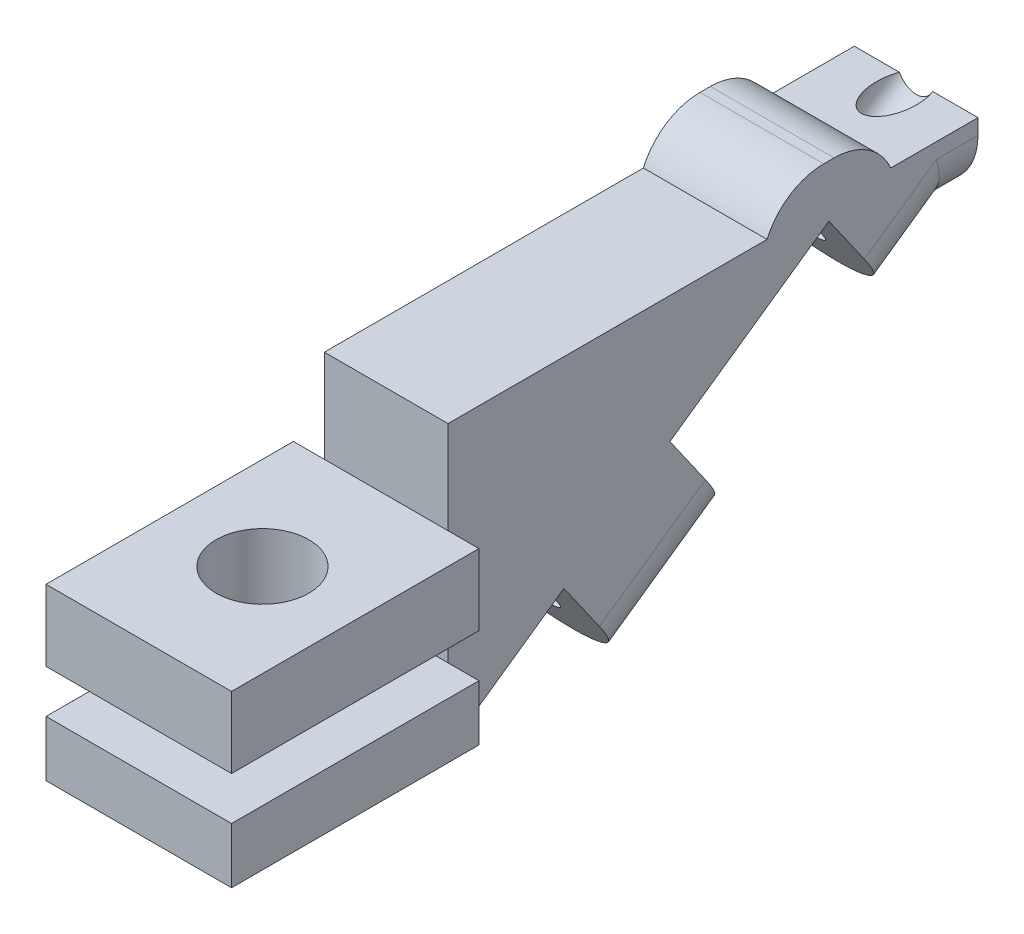
ISO-10303-21;
HEADER;
FILE_DESCRIPTION(('STEP AP214'),'2;1');
FILE_NAME('part.step','',(''),(''),'','','');
FILE_SCHEMA(('AUTOMOTIVE_DESIGN { 1 0 10303 214 1 1 1 1 }'));
ENDSEC;
DATA;
#1=APPLICATION_CONTEXT('core data for automotive mechanical design processes');
#2=APPLICATION_PROTOCOL_DEFINITION('international standard','automotive_design',2000,#1);
#3=PRODUCT_CONTEXT('',#1,'mechanical');
#4=PRODUCT('Part','Part','',(#3));
#5=PRODUCT_RELATED_PRODUCT_CATEGORY('part','',(#4));
#6=PRODUCT_DEFINITION_FORMATION('','',#4);
#7=PRODUCT_DEFINITION_CONTEXT('part definition',#1,'design');
#8=PRODUCT_DEFINITION('design','',#6,#7);
#9=PRODUCT_DEFINITION_SHAPE('','',#8);
#10=(LENGTH_UNIT() NAMED_UNIT(*) SI_UNIT(.MILLI.,.METRE.));
#11=(NAMED_UNIT(*) PLANE_ANGLE_UNIT() SI_UNIT($,.RADIAN.));
#12=(NAMED_UNIT(*) SI_UNIT($,.STERADIAN.) SOLID_ANGLE_UNIT());
#13=UNCERTAINTY_MEASURE_WITH_UNIT(LENGTH_MEASURE(1.E-05),#10,'distance_accuracy_value','');
#14=(GEOMETRIC_REPRESENTATION_CONTEXT(3) GLOBAL_UNCERTAINTY_ASSIGNED_CONTEXT((#13)) GLOBAL_UNIT_ASSIGNED_CONTEXT((#10,
#11,#12)) REPRESENTATION_CONTEXT('',''));
#15=CARTESIAN_POINT('',(0.,0.,0.));
#16=DIRECTION('',(0.,0.,1.));
#17=DIRECTION('',(1.,0.,0.));
#18=AXIS2_PLACEMENT_3D('',#15,#16,#17);
#19=CARTESIAN_POINT('',(22.9213615474532,7.5,28.1377760809054));
#20=DIRECTION('',(0.,-1.,0.));
#21=DIRECTION('',(0.,0.,-1.));
#22=AXIS2_PLACEMENT_3D('',#19,#20,#21);
#23=PLANE('',#22);
#24=DIRECTION('',(1.,0.,0.));
#25=VECTOR('',#24,1.);
#26=CARTESIAN_POINT('',(-2.,7.5,17.8212095985477));
#27=LINE('',#26,#25);
#28=CARTESIAN_POINT('',(-2.,7.5,17.8212095985477));
#29=VERTEX_POINT('',#28);
#30=CARTESIAN_POINT('',(2.,7.5,17.8212095985477));
#31=VERTEX_POINT('',#30);
#32=EDGE_CURVE('E255',#29,#31,#27,.T.);
#33=ORIENTED_EDGE('',*,*,#32,.F.);
#34=DIRECTION('',(0.,0.,-1.));
#35=VECTOR('',#34,1.);
#36=CARTESIAN_POINT('',(-2.,7.5,28.1377760809054));
#37=LINE('',#36,#35);
#38=CARTESIAN_POINT('',(-2.,7.5,28.1377760809054));
#39=VERTEX_POINT('',#38);
#40=EDGE_CURVE('E250',#39,#29,#37,.T.);
#41=ORIENTED_EDGE('',*,*,#40,.F.);
#42=DIRECTION('',(-1.,0.,0.));
#43=VECTOR('',#42,1.);
#44=CARTESIAN_POINT('',(22.9213615474532,7.5,28.1377760809054));
#45=LINE('',#44,#43);
#46=CARTESIAN_POINT('',(2.,7.5,28.1377760809054));
#47=VERTEX_POINT('',#46);
#48=EDGE_CURVE('E389',#47,#39,#45,.T.);
#49=ORIENTED_EDGE('',*,*,#48,.F.);
#50=DIRECTION('',(0.,0.,1.));
#51=VECTOR('',#50,1.);
#52=CARTESIAN_POINT('',(2.,7.5,28.1377760809054));
#53=LINE('',#52,#51);
#54=EDGE_CURVE('E402',#31,#47,#53,.T.);
#55=ORIENTED_EDGE('',*,*,#54,.F.);
#56=EDGE_LOOP('',(#33,#41,#49,#55));
#57=FACE_BOUND('',#56,.T.);
#58=ADVANCED_FACE('F35',(#57),#23,.F.);
#59=DIRECTION('',(-1.,0.,0.));
#60=VECTOR('',#59,1.);
#61=CARTESIAN_POINT('',(-2.,7.5,13.8212095985477));
#62=LINE('',#61,#60);
#63=CARTESIAN_POINT('',(2.,7.5,13.8212095985477));
#64=VERTEX_POINT('',#63);
#65=CARTESIAN_POINT('',(-2.,7.5,13.8212095985477));
#66=VERTEX_POINT('',#65);
#67=EDGE_CURVE('E244',#64,#66,#62,.T.);
#68=ORIENTED_EDGE('',*,*,#67,.F.);
#69=CARTESIAN_POINT('',(2.,7.5,11.));
#70=VERTEX_POINT('',#69);
#71=EDGE_CURVE('E399',#70,#64,#53,.T.);
#72=ORIENTED_EDGE('',*,*,#71,.F.);
#73=DIRECTION('',(-1.,0.,0.));
#74=VECTOR('',#73,1.);
#75=CARTESIAN_POINT('',(22.9213615474532,7.5,11.));
#76=LINE('',#75,#74);
#77=CARTESIAN_POINT('',(0.538540312853348,7.5,11.));
#78=VERTEX_POINT('',#77);
#79=EDGE_CURVE('E403',#70,#78,#76,.T.);
#80=ORIENTED_EDGE('',*,*,#79,.T.);
#81=CARTESIAN_POINT('',(0.,7.5,11.6345627386329));
#82=DIRECTION('',(0.,-1.,0.));
#83=DIRECTION('',(0.,0.,1.));
#84=AXIS2_PLACEMENT_3D('',#81,#82,#83);
#85=ELLIPSE('',#84,1.13324041715371,0.649999999999998);
#86=CARTESIAN_POINT('',(-0.538540312853348,7.5,11.));
#87=VERTEX_POINT('',#86);
#88=EDGE_CURVE('E368',#78,#87,#85,.T.);
#89=ORIENTED_EDGE('',*,*,#88,.T.);
#90=CARTESIAN_POINT('',(-2.,7.5,11.));
#91=VERTEX_POINT('',#90);
#92=EDGE_CURVE('E248',#87,#91,#76,.T.);
#93=ORIENTED_EDGE('',*,*,#92,.T.);
#94=EDGE_CURVE('E237',#66,#91,#37,.T.);
#95=ORIENTED_EDGE('',*,*,#94,.F.);
#96=EDGE_LOOP('',(#68,#72,#80,#89,#93,#95));
#97=FACE_BOUND('',#96,.T.);
#98=ADVANCED_FACE('F242',(#97),#23,.F.);
#99=CARTESIAN_POINT('',(3.,-1.,28.1377760809054));
#100=DIRECTION('',(0.,0.,-1.));
#101=DIRECTION('',(-1.,0.,0.));
#102=AXIS2_PLACEMENT_3D('',#99,#100,#101);
#103=PLANE('',#102);
#104=DIRECTION('',(0.,1.,0.));
#105=VECTOR('',#104,1.);
#106=CARTESIAN_POINT('',(-3.,-1.,28.1377760809054));
#107=LINE('',#106,#105);
#108=CARTESIAN_POINT('',(-3.,-1.,28.1377760809054));
#109=VERTEX_POINT('',#108);
#110=CARTESIAN_POINT('',(-3.,0.8,28.1377760809054));
#111=VERTEX_POINT('',#110);
#112=EDGE_CURVE('E365',#109,#111,#107,.T.);
#113=ORIENTED_EDGE('',*,*,#112,.T.);
#114=DIRECTION('',(-1.,0.,0.));
#115=VECTOR('',#114,1.);
#116=CARTESIAN_POINT('',(-3.,0.8,28.1377760809054));
#117=LINE('',#116,#115);
#118=CARTESIAN_POINT('',(-2.,0.8,28.1377760809054));
#119=VERTEX_POINT('',#118);
#120=EDGE_CURVE('E304',#119,#111,#117,.T.);
#121=ORIENTED_EDGE('',*,*,#120,.F.);
#122=DIRECTION('',(0.,1.,0.));
#123=VECTOR('',#122,1.);
#124=CARTESIAN_POINT('',(-2.,7.5,28.1377760809054));
#125=LINE('',#124,#123);
#126=CARTESIAN_POINT('',(-2.,-1.,28.1377760809054));
#127=VERTEX_POINT('',#126);
#128=EDGE_CURVE('E390',#127,#119,#125,.T.);
#129=ORIENTED_EDGE('',*,*,#128,.F.);
#130=DIRECTION('',(-1.,0.,0.));
#131=VECTOR('',#130,1.);
#132=CARTESIAN_POINT('',(3.,-1.,28.1377760809054));
#133=LINE('',#132,#131);
#134=EDGE_CURVE('E359',#127,#109,#133,.T.);
#135=ORIENTED_EDGE('',*,*,#134,.T.);
#136=EDGE_LOOP('',(#113,#121,#129,#135));
#137=FACE_BOUND('',#136,.T.);
#138=ADVANCED_FACE('F499',(#137),#103,.T.);
#139=DIRECTION('',(0.,-1.,0.));
#140=VECTOR('',#139,1.);
#141=CARTESIAN_POINT('',(2.,7.5,28.1377760809054));
#142=LINE('',#141,#140);
#143=CARTESIAN_POINT('',(2.,0.8,28.1377760809054));
#144=VERTEX_POINT('',#143);
#145=CARTESIAN_POINT('',(2.,-1.,28.1377760809054));
#146=VERTEX_POINT('',#145);
#147=EDGE_CURVE('E398',#144,#146,#142,.T.);
#148=ORIENTED_EDGE('',*,*,#147,.F.);
#149=CARTESIAN_POINT('',(3.,0.8,28.1377760809054));
#150=VERTEX_POINT('',#149);
#151=EDGE_CURVE('E305',#150,#144,#117,.T.);
#152=ORIENTED_EDGE('',*,*,#151,.F.);
#153=DIRECTION('',(0.,1.,0.));
#154=VECTOR('',#153,1.);
#155=CARTESIAN_POINT('',(3.,-1.,28.1377760809054));
#156=LINE('',#155,#154);
#157=CARTESIAN_POINT('',(3.,-1.,28.1377760809054));
#158=VERTEX_POINT('',#157);
#159=EDGE_CURVE('E370',#158,#150,#156,.T.);
#160=ORIENTED_EDGE('',*,*,#159,.F.);
#161=EDGE_CURVE('E360',#158,#146,#133,.T.);
#162=ORIENTED_EDGE('',*,*,#161,.T.);
#163=EDGE_LOOP('',(#148,#152,#160,#162));
#164=FACE_BOUND('',#163,.T.);
#165=ADVANCED_FACE('F647',(#164),#103,.T.);
#166=CARTESIAN_POINT('',(-3.,-1.,36.1377760809054));
#167=DIRECTION('',(-1.,0.,0.));
#168=DIRECTION('',(0.,0.,1.));
#169=AXIS2_PLACEMENT_3D('',#166,#167,#168);
#170=PLANE('',#169);
#171=DIRECTION('',(0.,1.,0.));
#172=VECTOR('',#171,1.);
#173=CARTESIAN_POINT('',(-3.,-1.,36.1377760809054));
#174=LINE('',#173,#172);
#175=CARTESIAN_POINT('',(-3.,-1.,36.1377760809054));
#176=VERTEX_POINT('',#175);
#177=CARTESIAN_POINT('',(-3.,0.8,36.1377760809054));
#178=VERTEX_POINT('',#177);
#179=EDGE_CURVE('E378',#176,#178,#174,.T.);
#180=ORIENTED_EDGE('',*,*,#179,.T.);
#181=DIRECTION('',(0.,0.,1.));
#182=VECTOR('',#181,1.);
#183=CARTESIAN_POINT('',(-3.,0.8,28.1377760809054));
#184=LINE('',#183,#182);
#185=EDGE_CURVE('E298',#111,#178,#184,.T.);
#186=ORIENTED_EDGE('',*,*,#185,.F.);
#187=ORIENTED_EDGE('',*,*,#112,.F.);
#188=DIRECTION('',(0.,0.,1.));
#189=VECTOR('',#188,1.);
#190=CARTESIAN_POINT('',(-3.,-1.,36.1377760809054));
#191=LINE('',#190,#189);
#192=EDGE_CURVE('E349',#109,#176,#191,.T.);
#193=ORIENTED_EDGE('',*,*,#192,.T.);
#194=EDGE_LOOP('',(#180,#186,#187,#193));
#195=FACE_BOUND('',#194,.T.);
#196=ADVANCED_FACE('F642',(#195),#170,.T.);
#197=CARTESIAN_POINT('',(3.,-1.,36.1377760809054));
#198=DIRECTION('',(1.,0.,0.));
#199=DIRECTION('',(0.,0.,-1.));
#200=AXIS2_PLACEMENT_3D('',#197,#198,#199);
#201=PLANE('',#200);
#202=ORIENTED_EDGE('',*,*,#159,.T.);
#203=DIRECTION('',(0.,0.,-1.));
#204=VECTOR('',#203,1.);
#205=CARTESIAN_POINT('',(3.,0.8,36.1377760809054));
#206=LINE('',#205,#204);
#207=CARTESIAN_POINT('',(3.,0.8,36.1377760809054));
#208=VERTEX_POINT('',#207);
#209=EDGE_CURVE('E302',#208,#150,#206,.T.);
#210=ORIENTED_EDGE('',*,*,#209,.F.);
#211=DIRECTION('',(0.,1.,0.));
#212=VECTOR('',#211,1.);
#213=CARTESIAN_POINT('',(3.,-1.,36.1377760809054));
#214=LINE('',#213,#212);
#215=CARTESIAN_POINT('',(3.,-1.,36.1377760809054));
#216=VERTEX_POINT('',#215);
#217=EDGE_CURVE('E374',#216,#208,#214,.T.);
#218=ORIENTED_EDGE('',*,*,#217,.F.);
#219=DIRECTION('',(0.,0.,-1.));
#220=VECTOR('',#219,1.);
#221=CARTESIAN_POINT('',(3.,-1.,36.1377760809054));
#222=LINE('',#221,#220);
#223=EDGE_CURVE('E356',#216,#158,#222,.T.);
#224=ORIENTED_EDGE('',*,*,#223,.T.);
#225=EDGE_LOOP('',(#202,#210,#218,#224));
#226=FACE_BOUND('',#225,.T.);
#227=ADVANCED_FACE('F636',(#226),#201,.T.);
#228=CARTESIAN_POINT('',(3.,-1.,36.1377760809054));
#229=DIRECTION('',(0.,0.,1.));
#230=DIRECTION('',(1.,0.,0.));
#231=AXIS2_PLACEMENT_3D('',#228,#229,#230);
#232=PLANE('',#231);
#233=ORIENTED_EDGE('',*,*,#217,.T.);
#234=DIRECTION('',(1.,0.,0.));
#235=VECTOR('',#234,1.);
#236=CARTESIAN_POINT('',(-3.,0.8,36.1377760809054));
#237=LINE('',#236,#235);
#238=EDGE_CURVE('E300',#178,#208,#237,.T.);
#239=ORIENTED_EDGE('',*,*,#238,.F.);
#240=ORIENTED_EDGE('',*,*,#179,.F.);
#241=DIRECTION('',(1.,0.,0.));
#242=VECTOR('',#241,1.);
#243=CARTESIAN_POINT('',(3.,-1.,36.1377760809054));
#244=LINE('',#243,#242);
#245=EDGE_CURVE('E353',#176,#216,#244,.T.);
#246=ORIENTED_EDGE('',*,*,#245,.T.);
#247=EDGE_LOOP('',(#233,#239,#240,#246));
#248=FACE_BOUND('',#247,.T.);
#249=ADVANCED_FACE('F639',(#248),#232,.T.);
#250=CARTESIAN_POINT('',(0.,-4.5,32.1377760809054));
#251=DIRECTION('',(0.,1.,0.));
#252=DIRECTION('',(0.,0.,1.));
#253=AXIS2_PLACEMENT_3D('',#250,#251,#252);
#254=CYLINDRICAL_SURFACE('',#253,1.5);
#255=CARTESIAN_POINT('',(0.,-1.,32.1377760809054));
#256=DIRECTION('',(0.,1.,0.));
#257=DIRECTION('',(0.,0.,1.));
#258=AXIS2_PLACEMENT_3D('',#255,#256,#257);
#259=CIRCLE('',#258,1.5);
#260=CARTESIAN_POINT('',(0.,-1.,33.6377760809054));
#261=VERTEX_POINT('',#260);
#262=EDGE_CURVE('E333',#261,#261,#259,.T.);
#263=ORIENTED_EDGE('',*,*,#262,.F.);
#264=EDGE_LOOP('',(#263));
#265=FACE_BOUND('',#264,.T.);
#266=CARTESIAN_POINT('',(0.,0.8,32.1377760809054));
#267=DIRECTION('',(0.,1.,0.));
#268=DIRECTION('',(0.,0.,1.));
#269=AXIS2_PLACEMENT_3D('',#266,#267,#268);
#270=CIRCLE('',#269,1.5);
#271=CARTESIAN_POINT('',(0.,0.8,33.6377760809054));
#272=VERTEX_POINT('',#271);
#273=EDGE_CURVE('E322',#272,#272,#270,.F.);
#274=ORIENTED_EDGE('',*,*,#273,.F.);
#275=EDGE_LOOP('',(#274));
#276=FACE_BOUND('',#275,.T.);
#277=ADVANCED_FACE('F622',(#265,#276),#254,.F.);
#278=CARTESIAN_POINT('',(22.9213615474532,7.5,28.1377760809054));
#279=DIRECTION('',(0.,0.,-1.));
#280=DIRECTION('',(-1.,0.,0.));
#281=AXIS2_PLACEMENT_3D('',#278,#279,#280);
#282=PLANE('',#281);
#283=DIRECTION('',(-1.,0.,0.));
#284=VECTOR('',#283,1.);
#285=CARTESIAN_POINT('',(3.,4.5,28.1377760809054));
#286=LINE('',#285,#284);
#287=CARTESIAN_POINT('',(2.,4.5,28.1377760809054));
#288=VERTEX_POINT('',#287);
#289=CARTESIAN_POINT('',(-2.,4.5,28.1377760809054));
#290=VERTEX_POINT('',#289);
#291=EDGE_CURVE('E350',#288,#290,#286,.T.);
#292=ORIENTED_EDGE('',*,*,#291,.F.);
#293=EDGE_CURVE('E394',#47,#288,#142,.T.);
#294=ORIENTED_EDGE('',*,*,#293,.F.);
#295=ORIENTED_EDGE('',*,*,#48,.T.);
#296=EDGE_CURVE('E386',#290,#39,#125,.T.);
#297=ORIENTED_EDGE('',*,*,#296,.F.);
#298=EDGE_LOOP('',(#292,#294,#295,#297));
#299=FACE_BOUND('',#298,.T.);
#300=ADVANCED_FACE('F512',(#299),#282,.F.);
#301=CARTESIAN_POINT('',(-2.,0.,0.));
#302=DIRECTION('',(1.,0.,0.));
#303=DIRECTION('',(0.,0.,-1.));
#304=AXIS2_PLACEMENT_3D('',#301,#302,#303);
#305=PLANE('',#304);
#306=DIRECTION('',(0.,0.,1.));
#307=VECTOR('',#306,1.);
#308=CARTESIAN_POINT('',(-2.,8.7,17.8212095985477));
#309=LINE('',#308,#307);
#310=CARTESIAN_POINT('',(-2.,8.7,15.6542398765301));
#311=VERTEX_POINT('',#310);
#312=CARTESIAN_POINT('',(-2.,8.7,15.9881793205654));
#313=VERTEX_POINT('',#312);
#314=EDGE_CURVE('E239',#311,#313,#309,.T.);
#315=ORIENTED_EDGE('',*,*,#314,.F.);
#316=CARTESIAN_POINT('',(-2.,6.7,15.6542398765301));
#317=DIRECTION('',(1.,0.,0.));
#318=DIRECTION('',(0.,0.,-1.));
#319=AXIS2_PLACEMENT_3D('',#316,#317,#318);
#320=CIRCLE('',#319,2.);
#321=EDGE_CURVE('E58',#311,#66,#320,.F.);
#322=ORIENTED_EDGE('',*,*,#321,.T.);
#323=ORIENTED_EDGE('',*,*,#94,.T.);
#324=DIRECTION('',(0.,-1.,0.));
#325=VECTOR('',#324,1.);
#326=CARTESIAN_POINT('',(-2.,7.5,11.));
#327=LINE('',#326,#325);
#328=CARTESIAN_POINT('',(-2.,7.,11.));
#329=VERTEX_POINT('',#328);
#330=EDGE_CURVE('E251',#91,#329,#327,.T.);
#331=ORIENTED_EDGE('',*,*,#330,.T.);
#332=DIRECTION('',(0.,0.,1.));
#333=VECTOR('',#332,1.);
#334=CARTESIAN_POINT('',(-2.,7.00000000000003,0.));
#335=LINE('',#334,#333);
#336=CARTESIAN_POINT('',(-2.,7.,12.3486367420039));
#337=VERTEX_POINT('',#336);
#338=EDGE_CURVE('E425',#329,#337,#335,.T.);
#339=ORIENTED_EDGE('',*,*,#338,.T.);
#340=DIRECTION('',(0.,-0.573576436351046,0.819152044288992));
#341=VECTOR('',#340,1.);
#342=CARTESIAN_POINT('',(-2.,10.4990319132532,7.35150128956423));
#343=LINE('',#342,#341);
#344=CARTESIAN_POINT('',(-2.,5.37172339781052,14.6740567258456));
#345=VERTEX_POINT('',#344);
#346=EDGE_CURVE('E423',#337,#345,#343,.T.);
#347=ORIENTED_EDGE('',*,*,#346,.T.);
#348=DIRECTION('',(0.,0.819152044288992,0.573576436351045));
#349=VECTOR('',#348,1.);
#350=CARTESIAN_POINT('',(-2.,-5.12730851544272,7.32255543628141));
#351=LINE('',#350,#349);
#352=CARTESIAN_POINT('',(-2.,7.01002748638851,15.8212095985477));
#353=VERTEX_POINT('',#352);
#354=EDGE_CURVE('E276',#345,#353,#351,.T.);
#355=ORIENTED_EDGE('',*,*,#354,.T.);
#356=DIRECTION('',(0.,-0.573576436351046,0.819152044288992));
#357=VECTOR('',#356,1.);
#358=CARTESIAN_POINT('',(-2.,12.1373360018312,8.49865416226633));
#359=LINE('',#358,#357);
#360=CARTESIAN_POINT('',(-2.,3.41002748638851,20.9625424228193));
#361=VERTEX_POINT('',#360);
#362=EDGE_CURVE('E295',#353,#361,#359,.T.);
#363=ORIENTED_EDGE('',*,*,#362,.T.);
#364=DIRECTION('',(0.,-0.819152044288992,-0.573576436351046));
#365=VECTOR('',#364,1.);
#366=CARTESIAN_POINT('',(-2.,-8.72730851544272,12.463888260553));
#367=LINE('',#366,#365);
#368=CARTESIAN_POINT('',(-2.,1.77172339781053,19.8153895501172));
#369=VERTEX_POINT('',#368);
#370=EDGE_CURVE('E282',#361,#369,#367,.T.);
#371=ORIENTED_EDGE('',*,*,#370,.T.);
#372=DIRECTION('',(0.,-0.573576436351047,0.819152044288991));
#373=VECTOR('',#372,1.);
#374=CARTESIAN_POINT('',(-2.,10.4990319132533,7.35150128956425));
#375=LINE('',#374,#373);
#376=CARTESIAN_POINT('',(-2.,-0.628276602189469,23.2429447662983));
#377=VERTEX_POINT('',#376);
#378=EDGE_CURVE('E428',#369,#377,#375,.T.);
#379=ORIENTED_EDGE('',*,*,#378,.T.);
#380=DIRECTION('',(0.,0.819152044288992,0.573576436351046));
#381=VECTOR('',#380,1.);
#382=CARTESIAN_POINT('',(-2.,-11.1273085154427,15.8914434767341));
#383=LINE('',#382,#381);
#384=CARTESIAN_POINT('',(-2.,1.01002748638852,24.3900976390004));
#385=VERTEX_POINT('',#384);
#386=EDGE_CURVE('E288',#377,#385,#383,.T.);
#387=ORIENTED_EDGE('',*,*,#386,.T.);
#388=DIRECTION('',(0.,-0.573576436351045,0.819152044288992));
#389=VECTOR('',#388,1.);
#390=CARTESIAN_POINT('',(-2.,12.1373360018312,8.49865416226631));
#391=LINE('',#390,#389);
#392=CARTESIAN_POINT('',(-2.,-1.61412520941935,28.1377760809054));
#393=VERTEX_POINT('',#392);
#394=EDGE_CURVE('E292',#385,#393,#391,.T.);
#395=ORIENTED_EDGE('',*,*,#394,.T.);
#396=EDGE_CURVE('E387',#393,#127,#125,.T.);
#397=ORIENTED_EDGE('',*,*,#396,.T.);
#398=ORIENTED_EDGE('',*,*,#128,.T.);
#399=DIRECTION('',(0.,-1.,0.));
#400=VECTOR('',#399,1.);
#401=CARTESIAN_POINT('',(-2.,0.,28.1377760809054));
#402=LINE('',#401,#400);
#403=CARTESIAN_POINT('',(-2.,2.2,28.1377760809054));
#404=VERTEX_POINT('',#403);
#405=EDGE_CURVE('E327',#404,#119,#402,.T.);
#406=ORIENTED_EDGE('',*,*,#405,.F.);
#407=EDGE_CURVE('E391',#404,#290,#125,.T.);
#408=ORIENTED_EDGE('',*,*,#407,.T.);
#409=ORIENTED_EDGE('',*,*,#296,.T.);
#410=ORIENTED_EDGE('',*,*,#40,.T.);
#411=CARTESIAN_POINT('',(-2.,6.7,15.9881793205654));
#412=DIRECTION('',(1.,0.,0.));
#413=DIRECTION('',(0.,0.,-1.));
#414=AXIS2_PLACEMENT_3D('',#411,#412,#413);
#415=CIRCLE('',#414,2.);
#416=EDGE_CURVE('E50',#29,#313,#415,.F.);
#417=ORIENTED_EDGE('',*,*,#416,.T.);
#418=EDGE_LOOP('',(#315,#322,#323,#331,#339,#347,#355,#363,#371,#379,#387,#395,#397,#398,#406,
#408,#409,#410,#417));
#419=FACE_BOUND('',#418,.T.);
#420=ADVANCED_FACE('F235',(#419),#305,.F.);
#421=CARTESIAN_POINT('',(2.,0.,0.));
#422=DIRECTION('',(1.,0.,0.));
#423=DIRECTION('',(0.,0.,-1.));
#424=AXIS2_PLACEMENT_3D('',#421,#422,#423);
#425=PLANE('',#424);
#426=ORIENTED_EDGE('',*,*,#71,.T.);
#427=CARTESIAN_POINT('',(2.,6.7,15.6542398765301));
#428=DIRECTION('',(1.,0.,0.));
#429=DIRECTION('',(0.,0.,-1.));
#430=AXIS2_PLACEMENT_3D('',#427,#428,#429);
#431=CIRCLE('',#430,2.);
#432=CARTESIAN_POINT('',(2.,8.7,15.6542398765301));
#433=VERTEX_POINT('',#432);
#434=EDGE_CURVE('E11',#64,#433,#431,.T.);
#435=ORIENTED_EDGE('',*,*,#434,.T.);
#436=DIRECTION('',(0.,0.,-1.));
#437=VECTOR('',#436,1.);
#438=CARTESIAN_POINT('',(2.,8.7,17.8212095985477));
#439=LINE('',#438,#437);
#440=CARTESIAN_POINT('',(2.,8.7,15.9881793205654));
#441=VERTEX_POINT('',#440);
#442=EDGE_CURVE('E258',#441,#433,#439,.T.);
#443=ORIENTED_EDGE('',*,*,#442,.F.);
#444=CARTESIAN_POINT('',(2.,6.7,15.9881793205654));
#445=DIRECTION('',(1.,0.,0.));
#446=DIRECTION('',(0.,0.,-1.));
#447=AXIS2_PLACEMENT_3D('',#444,#445,#446);
#448=CIRCLE('',#447,2.);
#449=EDGE_CURVE('E43',#441,#31,#448,.T.);
#450=ORIENTED_EDGE('',*,*,#449,.T.);
#451=ORIENTED_EDGE('',*,*,#54,.T.);
#452=ORIENTED_EDGE('',*,*,#293,.T.);
#453=CARTESIAN_POINT('',(2.,2.2,28.1377760809054));
#454=VERTEX_POINT('',#453);
#455=EDGE_CURVE('E397',#288,#454,#142,.T.);
#456=ORIENTED_EDGE('',*,*,#455,.T.);
#457=DIRECTION('',(0.,-1.,0.));
#458=VECTOR('',#457,1.);
#459=CARTESIAN_POINT('',(2.,0.,28.1377760809054));
#460=LINE('',#459,#458);
#461=EDGE_CURVE('E324',#454,#144,#460,.T.);
#462=ORIENTED_EDGE('',*,*,#461,.T.);
#463=ORIENTED_EDGE('',*,*,#147,.T.);
#464=CARTESIAN_POINT('',(2.,-1.61412520941935,28.1377760809054));
#465=VERTEX_POINT('',#464);
#466=EDGE_CURVE('E401',#146,#465,#142,.T.);
#467=ORIENTED_EDGE('',*,*,#466,.T.);
#468=DIRECTION('',(0.,-0.573576436351045,0.819152044288992));
#469=VECTOR('',#468,1.);
#470=CARTESIAN_POINT('',(2.,12.1373360018312,8.49865416226631));
#471=LINE('',#470,#469);
#472=CARTESIAN_POINT('',(2.,1.01002748638852,24.3900976390004));
#473=VERTEX_POINT('',#472);
#474=EDGE_CURVE('E290',#473,#465,#471,.T.);
#475=ORIENTED_EDGE('',*,*,#474,.F.);
#476=DIRECTION('',(0.,0.819152044288992,0.573576436351046));
#477=VECTOR('',#476,1.);
#478=CARTESIAN_POINT('',(2.,-11.1273085154427,15.8914434767341));
#479=LINE('',#478,#477);
#480=CARTESIAN_POINT('',(2.,-0.628276602189467,23.2429447662983));
#481=VERTEX_POINT('',#480);
#482=EDGE_CURVE('E286',#481,#473,#479,.T.);
#483=ORIENTED_EDGE('',*,*,#482,.F.);
#484=DIRECTION('',(0.,-0.573576436351047,0.819152044288991));
#485=VECTOR('',#484,1.);
#486=CARTESIAN_POINT('',(2.,1.77172339781053,19.8153895501172));
#487=LINE('',#486,#485);
#488=CARTESIAN_POINT('',(2.,1.77172339781054,19.8153895501172));
#489=VERTEX_POINT('',#488);
#490=EDGE_CURVE('E439',#481,#489,#487,.F.);
#491=ORIENTED_EDGE('',*,*,#490,.T.);
#492=DIRECTION('',(0.,-0.819152044288992,-0.573576436351046));
#493=VECTOR('',#492,1.);
#494=CARTESIAN_POINT('',(2.,-8.72730851544272,12.463888260553));
#495=LINE('',#494,#493);
#496=CARTESIAN_POINT('',(2.,3.41002748638851,20.9625424228193));
#497=VERTEX_POINT('',#496);
#498=EDGE_CURVE('E279',#497,#489,#495,.T.);
#499=ORIENTED_EDGE('',*,*,#498,.F.);
#500=DIRECTION('',(0.,-0.573576436351046,0.819152044288992));
#501=VECTOR('',#500,1.);
#502=CARTESIAN_POINT('',(2.,12.1373360018312,8.49865416226633));
#503=LINE('',#502,#501);
#504=CARTESIAN_POINT('',(2.,7.01002748638851,15.8212095985477));
#505=VERTEX_POINT('',#504);
#506=EDGE_CURVE('E421',#505,#497,#503,.T.);
#507=ORIENTED_EDGE('',*,*,#506,.F.);
#508=DIRECTION('',(0.,0.819152044288992,0.573576436351045));
#509=VECTOR('',#508,1.);
#510=CARTESIAN_POINT('',(2.,-5.12730851544272,7.32255543628141));
#511=LINE('',#510,#509);
#512=CARTESIAN_POINT('',(2.,5.37172339781052,14.6740567258456));
#513=VERTEX_POINT('',#512);
#514=EDGE_CURVE('E274',#513,#505,#511,.T.);
#515=ORIENTED_EDGE('',*,*,#514,.F.);
#516=DIRECTION('',(0.,-0.573576436351046,0.819152044288992));
#517=VECTOR('',#516,1.);
#518=CARTESIAN_POINT('',(2.,6.63830408857798,12.865192036948));
#519=LINE('',#518,#517);
#520=CARTESIAN_POINT('',(2.,7.,12.3486367420039));
#521=VERTEX_POINT('',#520);
#522=EDGE_CURVE('E435',#513,#521,#519,.F.);
#523=ORIENTED_EDGE('',*,*,#522,.T.);
#524=DIRECTION('',(0.,0.,1.));
#525=VECTOR('',#524,1.);
#526=CARTESIAN_POINT('',(2.,7.,11.));
#527=LINE('',#526,#525);
#528=CARTESIAN_POINT('',(2.,7.,11.));
#529=VERTEX_POINT('',#528);
#530=EDGE_CURVE('E437',#521,#529,#527,.F.);
#531=ORIENTED_EDGE('',*,*,#530,.T.);
#532=DIRECTION('',(0.,1.,0.));
#533=VECTOR('',#532,1.);
#534=CARTESIAN_POINT('',(2.,7.5,11.));
#535=LINE('',#534,#533);
#536=EDGE_CURVE('E392',#529,#70,#535,.T.);
#537=ORIENTED_EDGE('',*,*,#536,.T.);
#538=EDGE_LOOP('',(#426,#435,#443,#450,#451,#452,#456,#462,#463,#467,#475,#483,#491,#499,#507,
#515,#523,#531,#537));
#539=FACE_BOUND('',#538,.T.);
#540=ADVANCED_FACE('F473',(#539),#425,.T.);
#541=ORIENTED_EDGE('',*,*,#396,.F.);
#542=DIRECTION('',(1.,0.,0.));
#543=VECTOR('',#542,1.);
#544=CARTESIAN_POINT('',(22.9213615474532,-1.61412520941935,28.1377760809054));
#545=LINE('',#544,#543);
#546=EDGE_CURVE('E418',#393,#465,#545,.T.);
#547=ORIENTED_EDGE('',*,*,#546,.T.);
#548=ORIENTED_EDGE('',*,*,#466,.F.);
#549=EDGE_CURVE('E364',#146,#127,#133,.T.);
#550=ORIENTED_EDGE('',*,*,#549,.T.);
#551=EDGE_LOOP('',(#541,#547,#548,#550));
#552=FACE_BOUND('',#551,.T.);
#553=ADVANCED_FACE('F507',(#552),#282,.F.);
#554=CARTESIAN_POINT('',(22.9213615474532,7.5,11.));
#555=DIRECTION('',(0.,0.,1.));
#556=DIRECTION('',(1.,0.,0.));
#557=AXIS2_PLACEMENT_3D('',#554,#555,#556);
#558=PLANE('',#557);
#559=CARTESIAN_POINT('',(0.,7.,11.));
#560=DIRECTION('',(0.,0.,1.));
#561=DIRECTION('',(1.,0.,0.));
#562=AXIS2_PLACEMENT_3D('',#559,#560,#561);
#563=CIRCLE('',#562,2.);
#564=CARTESIAN_POINT('',(0.,5.,11.));
#565=VERTEX_POINT('',#564);
#566=EDGE_CURVE('E431',#529,#565,#563,.F.);
#567=ORIENTED_EDGE('',*,*,#566,.T.);
#568=CARTESIAN_POINT('',(0.,7.,11.));
#569=DIRECTION('',(0.,0.,1.));
#570=DIRECTION('',(1.,0.,0.));
#571=AXIS2_PLACEMENT_3D('',#568,#569,#570);
#572=CIRCLE('',#571,2.);
#573=EDGE_CURVE('E433',#565,#329,#572,.F.);
#574=ORIENTED_EDGE('',*,*,#573,.T.);
#575=ORIENTED_EDGE('',*,*,#330,.F.);
#576=ORIENTED_EDGE('',*,*,#92,.F.);
#577=CARTESIAN_POINT('',(0.,7.94432561305777,11.));
#578=DIRECTION('',(0.,0.,1.));
#579=DIRECTION('',(0.,-1.,0.));
#580=AXIS2_PLACEMENT_3D('',#577,#578,#579);
#581=ELLIPSE('',#580,0.793503482694945,0.649999999999998);
#582=EDGE_CURVE('E382',#87,#78,#581,.T.);
#583=ORIENTED_EDGE('',*,*,#582,.T.);
#584=ORIENTED_EDGE('',*,*,#79,.F.);
#585=ORIENTED_EDGE('',*,*,#536,.F.);
#586=EDGE_LOOP('',(#567,#574,#575,#576,#583,#584,#585));
#587=FACE_BOUND('',#586,.T.);
#588=ADVANCED_FACE('F504',(#587),#558,.F.);
#589=CARTESIAN_POINT('',(0.,15.7855342381398,-0.198406468359873));
#590=DIRECTION('',(0.,-0.573576436351047,0.819152044288991));
#591=DIRECTION('',(0.,-0.819152044288991,-0.573576436351047));
#592=AXIS2_PLACEMENT_3D('',#589,#590,#591);
#593=CYLINDRICAL_SURFACE('',#592,0.649999999999998);
#594=CARTESIAN_POINT('',(0.,5.37172339781056,14.6740567258456));
#595=DIRECTION('',(0.,0.573576436351045,-0.819152044288992));
#596=DIRECTION('',(0.,0.819152044288992,0.573576436351045));
#597=AXIS2_PLACEMENT_3D('',#594,#595,#596);
#598=CIRCLE('',#597,0.649999999999998);
#599=CARTESIAN_POINT('',(0.,5.9041722265984,15.0468814094738));
#600=VERTEX_POINT('',#599);
#601=EDGE_CURVE('E266',#600,#600,#598,.F.);
#602=ORIENTED_EDGE('',*,*,#601,.T.);
#603=EDGE_LOOP('',(#602));
#604=FACE_BOUND('',#603,.T.);
#605=ORIENTED_EDGE('',*,*,#88,.F.);
#606=ORIENTED_EDGE('',*,*,#582,.F.);
#607=EDGE_LOOP('',(#605,#606));
#608=FACE_BOUND('',#607,.T.);
#609=ADVANCED_FACE('F502',(#604,#608),#593,.F.);
#610=DIRECTION('',(-1.,0.,0.));
#611=VECTOR('',#610,1.);
#612=CARTESIAN_POINT('',(-3.,2.2,28.1377760809054));
#613=LINE('',#612,#611);
#614=CARTESIAN_POINT('',(-3.,2.2,28.1377760809054));
#615=VERTEX_POINT('',#614);
#616=EDGE_CURVE('E318',#404,#615,#613,.T.);
#617=ORIENTED_EDGE('',*,*,#616,.T.);
#618=CARTESIAN_POINT('',(-3.,4.5,28.1377760809054));
#619=VERTEX_POINT('',#618);
#620=EDGE_CURVE('E369',#615,#619,#107,.T.);
#621=ORIENTED_EDGE('',*,*,#620,.T.);
#622=EDGE_CURVE('E345',#290,#619,#286,.T.);
#623=ORIENTED_EDGE('',*,*,#622,.F.);
#624=ORIENTED_EDGE('',*,*,#407,.F.);
#625=EDGE_LOOP('',(#617,#621,#623,#624));
#626=FACE_BOUND('',#625,.T.);
#627=ADVANCED_FACE('F574',(#626),#103,.T.);
#628=CARTESIAN_POINT('',(3.,2.2,28.1377760809054));
#629=VERTEX_POINT('',#628);
#630=EDGE_CURVE('E319',#629,#454,#613,.T.);
#631=ORIENTED_EDGE('',*,*,#630,.T.);
#632=ORIENTED_EDGE('',*,*,#455,.F.);
#633=CARTESIAN_POINT('',(3.,4.5,28.1377760809054));
#634=VERTEX_POINT('',#633);
#635=EDGE_CURVE('E346',#634,#288,#286,.T.);
#636=ORIENTED_EDGE('',*,*,#635,.F.);
#637=EDGE_CURVE('E373',#629,#634,#156,.T.);
#638=ORIENTED_EDGE('',*,*,#637,.F.);
#639=EDGE_LOOP('',(#631,#632,#636,#638));
#640=FACE_BOUND('',#639,.T.);
#641=ADVANCED_FACE('F579',(#640),#103,.T.);
#642=DIRECTION('',(0.,0.,1.));
#643=VECTOR('',#642,1.);
#644=CARTESIAN_POINT('',(-3.,2.2,28.1377760809054));
#645=LINE('',#644,#643);
#646=CARTESIAN_POINT('',(-3.,2.2,36.1377760809054));
#647=VERTEX_POINT('',#646);
#648=EDGE_CURVE('E308',#615,#647,#645,.T.);
#649=ORIENTED_EDGE('',*,*,#648,.T.);
#650=CARTESIAN_POINT('',(-3.,4.5,36.1377760809054));
#651=VERTEX_POINT('',#650);
#652=EDGE_CURVE('E363',#647,#651,#174,.T.);
#653=ORIENTED_EDGE('',*,*,#652,.T.);
#654=DIRECTION('',(0.,0.,1.));
#655=VECTOR('',#654,1.);
#656=CARTESIAN_POINT('',(-3.,4.5,36.1377760809054));
#657=LINE('',#656,#655);
#658=EDGE_CURVE('E336',#619,#651,#657,.T.);
#659=ORIENTED_EDGE('',*,*,#658,.F.);
#660=ORIENTED_EDGE('',*,*,#620,.F.);
#661=EDGE_LOOP('',(#649,#653,#659,#660));
#662=FACE_BOUND('',#661,.T.);
#663=ADVANCED_FACE('F634',(#662),#170,.T.);
#664=DIRECTION('',(0.,0.,-1.));
#665=VECTOR('',#664,1.);
#666=CARTESIAN_POINT('',(3.,2.2,36.1377760809054));
#667=LINE('',#666,#665);
#668=CARTESIAN_POINT('',(3.,2.2,36.1377760809054));
#669=VERTEX_POINT('',#668);
#670=EDGE_CURVE('E315',#669,#629,#667,.T.);
#671=ORIENTED_EDGE('',*,*,#670,.T.);
#672=ORIENTED_EDGE('',*,*,#637,.T.);
#673=DIRECTION('',(0.,0.,-1.));
#674=VECTOR('',#673,1.);
#675=CARTESIAN_POINT('',(3.,4.5,36.1377760809054));
#676=LINE('',#675,#674);
#677=CARTESIAN_POINT('',(3.,4.5,36.1377760809054));
#678=VERTEX_POINT('',#677);
#679=EDGE_CURVE('E342',#678,#634,#676,.T.);
#680=ORIENTED_EDGE('',*,*,#679,.F.);
#681=EDGE_CURVE('E377',#669,#678,#214,.T.);
#682=ORIENTED_EDGE('',*,*,#681,.F.);
#683=EDGE_LOOP('',(#671,#672,#680,#682));
#684=FACE_BOUND('',#683,.T.);
#685=ADVANCED_FACE('F631',(#684),#201,.T.);
#686=DIRECTION('',(1.,0.,0.));
#687=VECTOR('',#686,1.);
#688=CARTESIAN_POINT('',(-3.,2.2,36.1377760809054));
#689=LINE('',#688,#687);
#690=EDGE_CURVE('E312',#647,#669,#689,.T.);
#691=ORIENTED_EDGE('',*,*,#690,.T.);
#692=ORIENTED_EDGE('',*,*,#681,.T.);
#693=DIRECTION('',(1.,0.,0.));
#694=VECTOR('',#693,1.);
#695=CARTESIAN_POINT('',(3.,4.5,36.1377760809054));
#696=LINE('',#695,#694);
#697=EDGE_CURVE('E339',#651,#678,#696,.T.);
#698=ORIENTED_EDGE('',*,*,#697,.F.);
#699=ORIENTED_EDGE('',*,*,#652,.F.);
#700=EDGE_LOOP('',(#691,#692,#698,#699));
#701=FACE_BOUND('',#700,.T.);
#702=ADVANCED_FACE('F628',(#701),#232,.T.);
#703=CARTESIAN_POINT('',(0.,-1.,0.));
#704=DIRECTION('',(0.,1.,0.));
#705=DIRECTION('',(0.,0.,1.));
#706=AXIS2_PLACEMENT_3D('',#703,#704,#705);
#707=PLANE('',#706);
#708=ORIENTED_EDGE('',*,*,#262,.T.);
#709=EDGE_LOOP('',(#708));
#710=FACE_BOUND('',#709,.T.);
#711=ORIENTED_EDGE('',*,*,#192,.F.);
#712=ORIENTED_EDGE('',*,*,#134,.F.);
#713=ORIENTED_EDGE('',*,*,#549,.F.);
#714=ORIENTED_EDGE('',*,*,#161,.F.);
#715=ORIENTED_EDGE('',*,*,#223,.F.);
#716=ORIENTED_EDGE('',*,*,#245,.F.);
#717=EDGE_LOOP('',(#711,#712,#713,#714,#715,#716));
#718=FACE_BOUND('',#717,.T.);
#719=ADVANCED_FACE('F625',(#710,#718),#707,.F.);
#720=CARTESIAN_POINT('',(0.,4.5,0.));
#721=DIRECTION('',(0.,1.,0.));
#722=DIRECTION('',(0.,0.,1.));
#723=AXIS2_PLACEMENT_3D('',#720,#721,#722);
#724=PLANE('',#723);
#725=CARTESIAN_POINT('',(0.,4.5,32.1377760809054));
#726=DIRECTION('',(0.,1.,0.));
#727=DIRECTION('',(0.,0.,1.));
#728=AXIS2_PLACEMENT_3D('',#725,#726,#727);
#729=CIRCLE('',#728,1.5);
#730=CARTESIAN_POINT('',(0.,4.5,33.6377760809054));
#731=VERTEX_POINT('',#730);
#732=EDGE_CURVE('E330',#731,#731,#729,.T.);
#733=ORIENTED_EDGE('',*,*,#732,.F.);
#734=EDGE_LOOP('',(#733));
#735=FACE_BOUND('',#734,.T.);
#736=ORIENTED_EDGE('',*,*,#658,.T.);
#737=ORIENTED_EDGE('',*,*,#697,.T.);
#738=ORIENTED_EDGE('',*,*,#679,.T.);
#739=ORIENTED_EDGE('',*,*,#635,.T.);
#740=ORIENTED_EDGE('',*,*,#291,.T.);
#741=ORIENTED_EDGE('',*,*,#622,.T.);
#742=EDGE_LOOP('',(#736,#737,#738,#739,#740,#741));
#743=FACE_BOUND('',#742,.T.);
#744=ADVANCED_FACE('F620',(#735,#743),#724,.T.);
#745=CARTESIAN_POINT('',(0.,2.2,32.1377760809054));
#746=DIRECTION('',(0.,1.,0.));
#747=DIRECTION('',(0.,0.,1.));
#748=AXIS2_PLACEMENT_3D('',#745,#746,#747);
#749=CIRCLE('',#748,1.5);
#750=CARTESIAN_POINT('',(0.,2.2,33.6377760809054));
#751=VERTEX_POINT('',#750);
#752=EDGE_CURVE('E328',#751,#751,#749,.F.);
#753=ORIENTED_EDGE('',*,*,#752,.T.);
#754=EDGE_LOOP('',(#753));
#755=FACE_BOUND('',#754,.T.);
#756=ORIENTED_EDGE('',*,*,#732,.T.);
#757=EDGE_LOOP('',(#756));
#758=FACE_BOUND('',#757,.T.);
#759=ADVANCED_FACE('F616',(#755,#758),#254,.F.);
#760=CARTESIAN_POINT('',(-3.,2.2,28.1377760809054));
#761=DIRECTION('',(0.,0.,1.));
#762=DIRECTION('',(1.,0.,0.));
#763=AXIS2_PLACEMENT_3D('',#760,#761,#762);
#764=PLANE('',#763);
#765=ORIENTED_EDGE('',*,*,#405,.T.);
#766=EDGE_CURVE('E309',#144,#119,#117,.T.);
#767=ORIENTED_EDGE('',*,*,#766,.F.);
#768=ORIENTED_EDGE('',*,*,#461,.F.);
#769=EDGE_CURVE('E323',#454,#404,#613,.T.);
#770=ORIENTED_EDGE('',*,*,#769,.T.);
#771=EDGE_LOOP('',(#765,#767,#768,#770));
#772=FACE_BOUND('',#771,.T.);
#773=ADVANCED_FACE('F612',(#772),#764,.T.);
#774=CARTESIAN_POINT('',(0.,2.2,0.));
#775=DIRECTION('',(0.,1.,0.));
#776=DIRECTION('',(0.,0.,1.));
#777=AXIS2_PLACEMENT_3D('',#774,#775,#776);
#778=PLANE('',#777);
#779=ORIENTED_EDGE('',*,*,#648,.F.);
#780=ORIENTED_EDGE('',*,*,#616,.F.);
#781=ORIENTED_EDGE('',*,*,#769,.F.);
#782=ORIENTED_EDGE('',*,*,#630,.F.);
#783=ORIENTED_EDGE('',*,*,#670,.F.);
#784=ORIENTED_EDGE('',*,*,#690,.F.);
#785=EDGE_LOOP('',(#779,#780,#781,#782,#783,#784));
#786=FACE_BOUND('',#785,.T.);
#787=ORIENTED_EDGE('',*,*,#752,.F.);
#788=EDGE_LOOP('',(#787));
#789=FACE_BOUND('',#788,.T.);
#790=ADVANCED_FACE('F608',(#786,#789),#778,.F.);
#791=CARTESIAN_POINT('',(0.,0.8,0.));
#792=DIRECTION('',(0.,1.,0.));
#793=DIRECTION('',(0.,0.,1.));
#794=AXIS2_PLACEMENT_3D('',#791,#792,#793);
#795=PLANE('',#794);
#796=ORIENTED_EDGE('',*,*,#185,.T.);
#797=ORIENTED_EDGE('',*,*,#238,.T.);
#798=ORIENTED_EDGE('',*,*,#209,.T.);
#799=ORIENTED_EDGE('',*,*,#151,.T.);
#800=ORIENTED_EDGE('',*,*,#766,.T.);
#801=ORIENTED_EDGE('',*,*,#120,.T.);
#802=EDGE_LOOP('',(#796,#797,#798,#799,#800,#801));
#803=FACE_BOUND('',#802,.T.);
#804=ORIENTED_EDGE('',*,*,#273,.T.);
#805=EDGE_LOOP('',(#804));
#806=FACE_BOUND('',#805,.T.);
#807=ADVANCED_FACE('F604',(#803,#806),#795,.T.);
#808=CARTESIAN_POINT('',(-6.,7.01002748638851,15.8212095985477));
#809=DIRECTION('',(0.,0.819152044288992,0.573576436351046));
#810=DIRECTION('',(0.,-0.573576436351046,0.819152044288992));
#811=AXIS2_PLACEMENT_3D('',#808,#809,#810);
#812=PLANE('',#811);
#813=DIRECTION('',(1.,0.,0.));
#814=VECTOR('',#813,1.);
#815=CARTESIAN_POINT('',(-6.,7.01002748638851,15.8212095985477));
#816=LINE('',#815,#814);
#817=EDGE_CURVE('E270',#353,#505,#816,.T.);
#818=ORIENTED_EDGE('',*,*,#817,.T.);
#819=ORIENTED_EDGE('',*,*,#506,.T.);
#820=DIRECTION('',(1.,0.,0.));
#821=VECTOR('',#820,1.);
#822=CARTESIAN_POINT('',(-6.,3.41002748638851,20.9625424228193));
#823=LINE('',#822,#821);
#824=EDGE_CURVE('E267',#361,#497,#823,.T.);
#825=ORIENTED_EDGE('',*,*,#824,.F.);
#826=ORIENTED_EDGE('',*,*,#362,.F.);
#827=EDGE_LOOP('',(#818,#819,#825,#826));
#828=FACE_BOUND('',#827,.T.);
#829=ADVANCED_FACE('F552',(#828),#812,.F.);
#830=CARTESIAN_POINT('',(-6.,1.01002748638852,24.3900976390004));
#831=DIRECTION('',(0.,0.819152044288992,0.573576436351045));
#832=DIRECTION('',(0.,-0.573576436351045,0.819152044288992));
#833=AXIS2_PLACEMENT_3D('',#830,#831,#832);
#834=PLANE('',#833);
#835=DIRECTION('',(1.,0.,0.));
#836=VECTOR('',#835,1.);
#837=CARTESIAN_POINT('',(-6.,1.01002748638852,24.3900976390004));
#838=LINE('',#837,#836);
#839=EDGE_CURVE('E263',#385,#473,#838,.T.);
#840=ORIENTED_EDGE('',*,*,#839,.T.);
#841=ORIENTED_EDGE('',*,*,#474,.T.);
#842=ORIENTED_EDGE('',*,*,#546,.F.);
#843=ORIENTED_EDGE('',*,*,#394,.F.);
#844=EDGE_LOOP('',(#840,#841,#842,#843));
#845=FACE_BOUND('',#844,.T.);
#846=ADVANCED_FACE('F599',(#845),#834,.F.);
#847=CARTESIAN_POINT('',(-6.,-2.26658069076745,22.0957918935962));
#848=DIRECTION('',(0.,0.573576436351046,-0.819152044288992));
#849=DIRECTION('',(0.,0.819152044288992,0.573576436351046));
#850=AXIS2_PLACEMENT_3D('',#847,#848,#849);
#851=PLANE('',#850);
#852=CARTESIAN_POINT('',(0.,-0.628276602189462,23.2429447662983));
#853=DIRECTION('',(0.,0.573576436351046,-0.819152044288992));
#854=DIRECTION('',(0.,0.819152044288992,0.573576436351046));
#855=AXIS2_PLACEMENT_3D('',#852,#853,#854);
#856=CIRCLE('',#855,0.649999999999998);
#857=CARTESIAN_POINT('',(0.,-0.0958277734016184,23.6157694499265));
#858=VERTEX_POINT('',#857);
#859=EDGE_CURVE('E285',#858,#858,#856,.F.);
#860=ORIENTED_EDGE('',*,*,#859,.F.);
#861=EDGE_LOOP('',(#860));
#862=FACE_BOUND('',#861,.T.);
#863=ORIENTED_EDGE('',*,*,#386,.F.);
#864=CARTESIAN_POINT('',(0.,-0.628276602189472,23.2429447662983));
#865=DIRECTION('',(0.,0.573576436351046,-0.819152044288992));
#866=DIRECTION('',(0.,0.819152044288992,0.573576436351046));
#867=AXIS2_PLACEMENT_3D('',#864,#865,#866);
#868=CIRCLE('',#867,2.);
#869=CARTESIAN_POINT('',(0.,-2.26658069076745,22.0957918935962));
#870=VERTEX_POINT('',#869);
#871=EDGE_CURVE('E443',#377,#870,#868,.F.);
#872=ORIENTED_EDGE('',*,*,#871,.T.);
#873=CARTESIAN_POINT('',(0.,-0.628276602189469,23.2429447662983));
#874=DIRECTION('',(0.,0.573576436351046,-0.819152044288992));
#875=DIRECTION('',(0.,0.819152044288992,0.573576436351046));
#876=AXIS2_PLACEMENT_3D('',#873,#874,#875);
#877=CIRCLE('',#876,2.);
#878=EDGE_CURVE('E441',#870,#481,#877,.F.);
#879=ORIENTED_EDGE('',*,*,#878,.T.);
#880=ORIENTED_EDGE('',*,*,#482,.T.);
#881=ORIENTED_EDGE('',*,*,#839,.F.);
#882=EDGE_LOOP('',(#863,#872,#879,#880,#881));
#883=FACE_BOUND('',#882,.T.);
#884=ADVANCED_FACE('F594',(#862,#883),#851,.F.);
#885=CARTESIAN_POINT('',(-6.,3.41002748638851,20.9625424228193));
#886=DIRECTION('',(0.,-0.573576436351046,0.819152044288992));
#887=DIRECTION('',(0.,-0.819152044288992,-0.573576436351046));
#888=AXIS2_PLACEMENT_3D('',#885,#886,#887);
#889=PLANE('',#888);
#890=CARTESIAN_POINT('',(0.,1.77172339781055,19.8153895501172));
#891=DIRECTION('',(0.,-0.573576436351046,0.819152044288992));
#892=DIRECTION('',(0.,-0.819152044288992,-0.573576436351046));
#893=AXIS2_PLACEMENT_3D('',#890,#891,#892);
#894=CIRCLE('',#893,0.649999999999998);
#895=CARTESIAN_POINT('',(0.,1.23927456902271,19.4425648664891));
#896=VERTEX_POINT('',#895);
#897=EDGE_CURVE('E278',#896,#896,#894,.F.);
#898=ORIENTED_EDGE('',*,*,#897,.F.);
#899=EDGE_LOOP('',(#898));
#900=FACE_BOUND('',#899,.T.);
#901=CARTESIAN_POINT('',(0.,1.77172339781053,19.8153895501172));
#902=DIRECTION('',(0.,-0.573576436351046,0.819152044288992));
#903=DIRECTION('',(0.,-0.819152044288992,-0.573576436351046));
#904=AXIS2_PLACEMENT_3D('',#901,#902,#903);
#905=CIRCLE('',#904,2.);
#906=CARTESIAN_POINT('',(0.,0.13341930923255,18.6682366774151));
#907=VERTEX_POINT('',#906);
#908=EDGE_CURVE('E445',#489,#907,#905,.F.);
#909=ORIENTED_EDGE('',*,*,#908,.T.);
#910=CARTESIAN_POINT('',(0.,1.77172339781053,19.8153895501172));
#911=DIRECTION('',(0.,-0.573576436351046,0.819152044288992));
#912=DIRECTION('',(0.,-0.819152044288992,-0.573576436351046));
#913=AXIS2_PLACEMENT_3D('',#910,#911,#912);
#914=CIRCLE('',#913,2.);
#915=EDGE_CURVE('E447',#907,#369,#914,.F.);
#916=ORIENTED_EDGE('',*,*,#915,.T.);
#917=ORIENTED_EDGE('',*,*,#370,.F.);
#918=ORIENTED_EDGE('',*,*,#824,.T.);
#919=ORIENTED_EDGE('',*,*,#498,.T.);
#920=EDGE_LOOP('',(#909,#916,#917,#918,#919));
#921=FACE_BOUND('',#920,.T.);
#922=ADVANCED_FACE('F545',(#900,#921),#889,.F.);
#923=CARTESIAN_POINT('',(-6.,3.73341930923254,13.5269038531435));
#924=DIRECTION('',(0.,0.573576436351045,-0.819152044288992));
#925=DIRECTION('',(0.,0.819152044288992,0.573576436351045));
#926=AXIS2_PLACEMENT_3D('',#923,#924,#925);
#927=PLANE('',#926);
#928=ORIENTED_EDGE('',*,*,#601,.F.);
#929=EDGE_LOOP('',(#928));
#930=FACE_BOUND('',#929,.T.);
#931=ORIENTED_EDGE('',*,*,#354,.F.);
#932=CARTESIAN_POINT('',(0.,5.37172339781053,14.6740567258456));
#933=DIRECTION('',(0.,0.573576436351045,-0.819152044288992));
#934=DIRECTION('',(0.,0.819152044288992,0.573576436351045));
#935=AXIS2_PLACEMENT_3D('',#932,#933,#934);
#936=CIRCLE('',#935,2.);
#937=CARTESIAN_POINT('',(0.,3.73341930923254,13.5269038531435));
#938=VERTEX_POINT('',#937);
#939=EDGE_CURVE('E451',#345,#938,#936,.F.);
#940=ORIENTED_EDGE('',*,*,#939,.T.);
#941=CARTESIAN_POINT('',(0.,5.37172339781053,14.6740567258456));
#942=DIRECTION('',(0.,0.573576436351045,-0.819152044288992));
#943=DIRECTION('',(0.,0.819152044288992,0.573576436351045));
#944=AXIS2_PLACEMENT_3D('',#941,#942,#943);
#945=CIRCLE('',#944,2.);
#946=EDGE_CURVE('E449',#938,#513,#945,.F.);
#947=ORIENTED_EDGE('',*,*,#946,.T.);
#948=ORIENTED_EDGE('',*,*,#514,.T.);
#949=ORIENTED_EDGE('',*,*,#817,.F.);
#950=EDGE_LOOP('',(#931,#940,#947,#948,#949));
#951=FACE_BOUND('',#950,.T.);
#952=ADVANCED_FACE('F555',(#930,#951),#927,.F.);
#953=ORIENTED_EDGE('',*,*,#859,.T.);
#954=EDGE_LOOP('',(#953));
#955=FACE_BOUND('',#954,.T.);
#956=ORIENTED_EDGE('',*,*,#897,.T.);
#957=EDGE_LOOP('',(#956));
#958=FACE_BOUND('',#957,.T.);
#959=ADVANCED_FACE('F531',(#955,#958),#593,.F.);
#960=CARTESIAN_POINT('',(0.,6.63830408857798,12.865192036948));
#961=DIRECTION('',(0.,0.573576436351046,-0.819152044288992));
#962=DIRECTION('',(0.,0.819152044288992,0.573576436351046));
#963=AXIS2_PLACEMENT_3D('',#960,#961,#962);
#964=CYLINDRICAL_SURFACE('',#963,2.);
#965=CARTESIAN_POINT('',(0.,7.,12.3486367420039));
#966=DIRECTION('',(0.,0.300705799504274,-0.953716950748227));
#967=DIRECTION('',(0.,-0.953716950748227,-0.300705799504274));
#968=AXIS2_PLACEMENT_3D('',#965,#966,#967);
#969=ELLIPSE('',#968,2.09705825028162,2.);
#970=CARTESIAN_POINT('',(0.,5.,11.7180391642459));
#971=VERTEX_POINT('',#970);
#972=EDGE_CURVE('E273',#521,#971,#969,.T.);
#973=ORIENTED_EDGE('',*,*,#972,.F.);
#974=ORIENTED_EDGE('',*,*,#522,.F.);
#975=ORIENTED_EDGE('',*,*,#946,.F.);
#976=DIRECTION('',(0.,-0.573576436351046,0.819152044288992));
#977=VECTOR('',#976,1.);
#978=CARTESIAN_POINT('',(0.,3.73341930923254,13.5269038531435));
#979=LINE('',#978,#977);
#980=EDGE_CURVE('E460',#971,#938,#979,.T.);
#981=ORIENTED_EDGE('',*,*,#980,.F.);
#982=EDGE_LOOP('',(#973,#974,#975,#981));
#983=FACE_BOUND('',#982,.T.);
#984=ADVANCED_FACE('F528',(#983),#964,.T.);
#985=CARTESIAN_POINT('',(0.,7.00000000000006,-10.7795608262648));
#986=DIRECTION('',(0.,0.,-1.));
#987=DIRECTION('',(0.,1.,0.));
#988=AXIS2_PLACEMENT_3D('',#985,#986,#987);
#989=CYLINDRICAL_SURFACE('',#988,2.);
#990=ORIENTED_EDGE('',*,*,#530,.F.);
#991=ORIENTED_EDGE('',*,*,#972,.T.);
#992=DIRECTION('',(0.,0.,1.));
#993=VECTOR('',#992,1.);
#994=CARTESIAN_POINT('',(0.,5.,11.7180391642459));
#995=LINE('',#994,#993);
#996=EDGE_CURVE('E456',#565,#971,#995,.T.);
#997=ORIENTED_EDGE('',*,*,#996,.F.);
#998=ORIENTED_EDGE('',*,*,#566,.F.);
#999=EDGE_LOOP('',(#990,#991,#997,#998));
#1000=FACE_BOUND('',#999,.T.);
#1001=ADVANCED_FACE('F524',(#1000),#989,.T.);
#1002=CARTESIAN_POINT('',(0.,10.4990319132532,7.35150128956423));
#1003=DIRECTION('',(0.,-0.573576436351046,0.819152044288992));
#1004=DIRECTION('',(0.,-0.819152044288992,-0.573576436351046));
#1005=AXIS2_PLACEMENT_3D('',#1002,#1003,#1004);
#1006=CYLINDRICAL_SURFACE('',#1005,2.);
#1007=ORIENTED_EDGE('',*,*,#939,.F.);
#1008=ORIENTED_EDGE('',*,*,#346,.F.);
#1009=CARTESIAN_POINT('',(0.,7.,12.3486367420039));
#1010=DIRECTION('',(0.,-0.300705799504274,0.953716950748227));
#1011=DIRECTION('',(0.,0.953716950748227,0.300705799504274));
#1012=AXIS2_PLACEMENT_3D('',#1009,#1010,#1011);
#1013=ELLIPSE('',#1012,2.09705825028162,2.);
#1014=EDGE_CURVE('E454',#971,#337,#1013,.F.);
#1015=ORIENTED_EDGE('',*,*,#1014,.F.);
#1016=ORIENTED_EDGE('',*,*,#980,.T.);
#1017=EDGE_LOOP('',(#1007,#1008,#1015,#1016));
#1018=FACE_BOUND('',#1017,.T.);
#1019=ADVANCED_FACE('F520',(#1018),#1006,.T.);
#1020=CARTESIAN_POINT('',(0.,7.00000000000003,0.));
#1021=DIRECTION('',(0.,0.,1.));
#1022=DIRECTION('',(0.,-1.,0.));
#1023=AXIS2_PLACEMENT_3D('',#1020,#1021,#1022);
#1024=CYLINDRICAL_SURFACE('',#1023,2.);
#1025=ORIENTED_EDGE('',*,*,#573,.F.);
#1026=ORIENTED_EDGE('',*,*,#996,.T.);
#1027=ORIENTED_EDGE('',*,*,#1014,.T.);
#1028=ORIENTED_EDGE('',*,*,#338,.F.);
#1029=EDGE_LOOP('',(#1025,#1026,#1027,#1028));
#1030=FACE_BOUND('',#1029,.T.);
#1031=ADVANCED_FACE('F517',(#1030),#1024,.T.);
#1032=CARTESIAN_POINT('',(0.,1.77172339781053,19.8153895501172));
#1033=DIRECTION('',(0.,0.573576436351047,-0.819152044288991));
#1034=DIRECTION('',(0.,0.819152044288992,0.573576436351047));
#1035=AXIS2_PLACEMENT_3D('',#1032,#1033,#1034);
#1036=CYLINDRICAL_SURFACE('',#1035,2.);
#1037=DIRECTION('',(0.,-0.573576436351047,0.819152044288991));
#1038=VECTOR('',#1037,1.);
#1039=CARTESIAN_POINT('',(0.,-2.26658069076745,22.0957918935962));
#1040=LINE('',#1039,#1038);
#1041=EDGE_CURVE('E457',#907,#870,#1040,.T.);
#1042=ORIENTED_EDGE('',*,*,#1041,.F.);
#1043=ORIENTED_EDGE('',*,*,#908,.F.);
#1044=ORIENTED_EDGE('',*,*,#490,.F.);
#1045=ORIENTED_EDGE('',*,*,#878,.F.);
#1046=EDGE_LOOP('',(#1042,#1043,#1044,#1045));
#1047=FACE_BOUND('',#1046,.T.);
#1048=ADVANCED_FACE('F490',(#1047),#1036,.T.);
#1049=CARTESIAN_POINT('',(0.,10.4990319132533,7.35150128956425));
#1050=DIRECTION('',(0.,-0.573576436351047,0.819152044288991));
#1051=DIRECTION('',(0.,-0.819152044288992,-0.573576436351047));
#1052=AXIS2_PLACEMENT_3D('',#1049,#1050,#1051);
#1053=CYLINDRICAL_SURFACE('',#1052,2.);
#1054=ORIENTED_EDGE('',*,*,#915,.F.);
#1055=ORIENTED_EDGE('',*,*,#1041,.T.);
#1056=ORIENTED_EDGE('',*,*,#871,.F.);
#1057=ORIENTED_EDGE('',*,*,#378,.F.);
#1058=EDGE_LOOP('',(#1054,#1055,#1056,#1057));
#1059=FACE_BOUND('',#1058,.T.);
#1060=ADVANCED_FACE('F484',(#1059),#1053,.T.);
#1061=CARTESIAN_POINT('',(0.,8.7,0.));
#1062=DIRECTION('',(0.,-1.,0.));
#1063=DIRECTION('',(0.,0.,-1.));
#1064=AXIS2_PLACEMENT_3D('',#1061,#1062,#1063);
#1065=PLANE('',#1064);
#1066=ORIENTED_EDGE('',*,*,#442,.T.);
#1067=DIRECTION('',(1.,0.,0.));
#1068=VECTOR('',#1067,1.);
#1069=CARTESIAN_POINT('',(0.,8.7,15.6542398765301));
#1070=LINE('',#1069,#1068);
#1071=EDGE_CURVE('E468',#433,#311,#1070,.F.);
#1072=ORIENTED_EDGE('',*,*,#1071,.T.);
#1073=ORIENTED_EDGE('',*,*,#314,.T.);
#1074=DIRECTION('',(-1.,0.,0.));
#1075=VECTOR('',#1074,1.);
#1076=CARTESIAN_POINT('',(0.,8.7,15.9881793205654));
#1077=LINE('',#1076,#1075);
#1078=EDGE_CURVE('E453',#313,#441,#1077,.F.);
#1079=ORIENTED_EDGE('',*,*,#1078,.T.);
#1080=EDGE_LOOP('',(#1066,#1072,#1073,#1079));
#1081=FACE_BOUND('',#1080,.T.);
#1082=ADVANCED_FACE('F482',(#1081),#1065,.F.);
#1083=CARTESIAN_POINT('',(-2.,6.7,15.6542398765301));
#1084=DIRECTION('',(1.,0.,0.));
#1085=DIRECTION('',(0.,0.,-1.));
#1086=AXIS2_PLACEMENT_3D('',#1083,#1084,#1085);
#1087=CYLINDRICAL_SURFACE('',#1086,2.);
#1088=ORIENTED_EDGE('',*,*,#434,.F.);
#1089=ORIENTED_EDGE('',*,*,#67,.T.);
#1090=ORIENTED_EDGE('',*,*,#321,.F.);
#1091=ORIENTED_EDGE('',*,*,#1071,.F.);
#1092=EDGE_LOOP('',(#1088,#1089,#1090,#1091));
#1093=FACE_BOUND('',#1092,.T.);
#1094=ADVANCED_FACE('F254',(#1093),#1087,.T.);
#1095=CARTESIAN_POINT('',(-2.,6.7,15.9881793205654));
#1096=DIRECTION('',(-1.,0.,0.));
#1097=DIRECTION('',(0.,0.,1.));
#1098=AXIS2_PLACEMENT_3D('',#1095,#1096,#1097);
#1099=CYLINDRICAL_SURFACE('',#1098,2.);
#1100=ORIENTED_EDGE('',*,*,#416,.F.);
#1101=ORIENTED_EDGE('',*,*,#32,.T.);
#1102=ORIENTED_EDGE('',*,*,#449,.F.);
#1103=ORIENTED_EDGE('',*,*,#1078,.F.);
#1104=EDGE_LOOP('',(#1100,#1101,#1102,#1103));
#1105=FACE_BOUND('',#1104,.T.);
#1106=ADVANCED_FACE('F37',(#1105),#1099,.T.);
#1107=CLOSED_SHELL('',(#58,#98,#138,#165,#196,#227,#249,#277,#300,#420,#540,#553,#588,#609,#627,
#641,#663,#685,#702,#719,#744,#759,#773,#790,#807,#829,#846,#884,#922,#952,#959,#984,#1001,
#1019,#1031,#1048,#1060,#1082,#1094,#1106));
#1108=MANIFOLD_SOLID_BREP('B2',#1107);
#1109=ADVANCED_BREP_SHAPE_REPRESENTATION('',(#18,#1108),#14);
#1110=SHAPE_DEFINITION_REPRESENTATION(#9,#1109);
ENDSEC;
END-ISO-10303-21;
